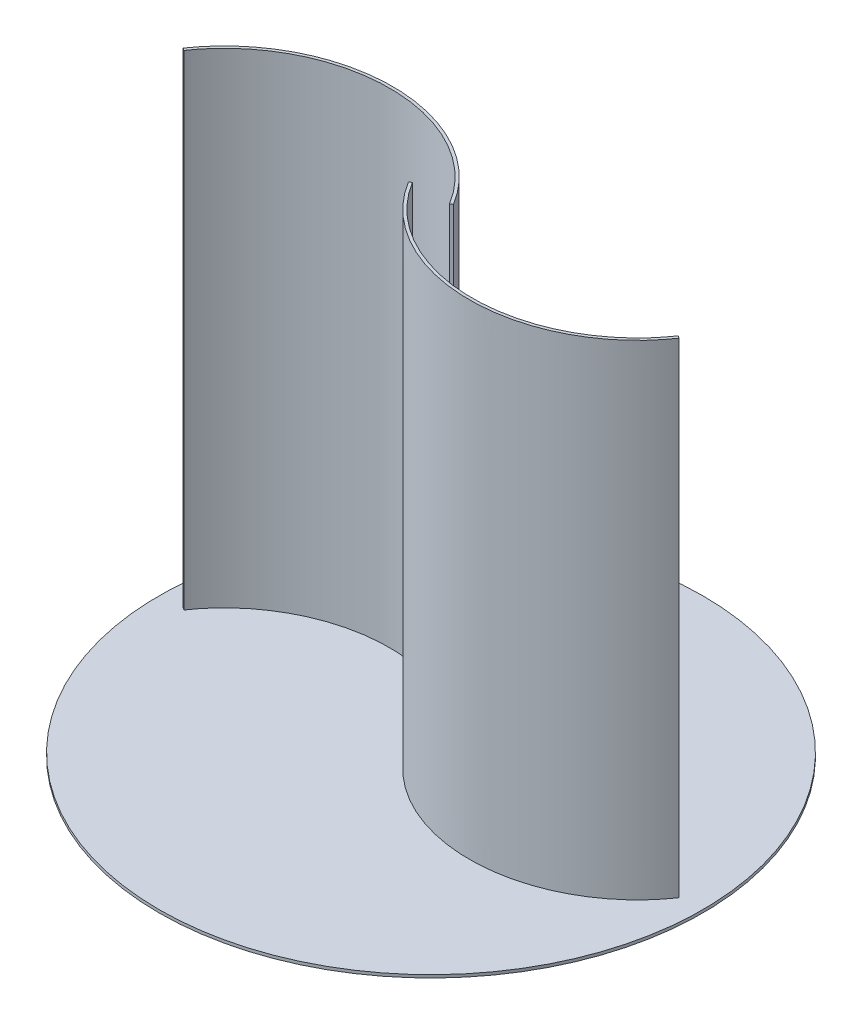
ISO-10303-21;
HEADER;
FILE_DESCRIPTION(('STEP AP214'),'2;1');
FILE_NAME('part.step','',(''),(''),'','','');
FILE_SCHEMA(('AUTOMOTIVE_DESIGN { 1 0 10303 214 1 1 1 1 }'));
ENDSEC;
DATA;
#1=APPLICATION_CONTEXT('core data for automotive mechanical design processes');
#2=APPLICATION_PROTOCOL_DEFINITION('international standard','automotive_design',2000,#1);
#3=PRODUCT_CONTEXT('',#1,'mechanical');
#4=PRODUCT('Part','Part','',(#3));
#5=PRODUCT_RELATED_PRODUCT_CATEGORY('part','',(#4));
#6=PRODUCT_DEFINITION_FORMATION('','',#4);
#7=PRODUCT_DEFINITION_CONTEXT('part definition',#1,'design');
#8=PRODUCT_DEFINITION('design','',#6,#7);
#9=PRODUCT_DEFINITION_SHAPE('','',#8);
#10=(LENGTH_UNIT() NAMED_UNIT(*) SI_UNIT(.MILLI.,.METRE.));
#11=(NAMED_UNIT(*) PLANE_ANGLE_UNIT() SI_UNIT($,.RADIAN.));
#12=(NAMED_UNIT(*) SI_UNIT($,.STERADIAN.) SOLID_ANGLE_UNIT());
#13=UNCERTAINTY_MEASURE_WITH_UNIT(LENGTH_MEASURE(1.E-05),#10,'distance_accuracy_value','');
#14=(GEOMETRIC_REPRESENTATION_CONTEXT(3) GLOBAL_UNCERTAINTY_ASSIGNED_CONTEXT((#13)) GLOBAL_UNIT_ASSIGNED_CONTEXT((#10,
#11,#12)) REPRESENTATION_CONTEXT('',''));
#15=CARTESIAN_POINT('',(0.,0.,0.));
#16=DIRECTION('',(0.,0.,1.));
#17=DIRECTION('',(1.,0.,0.));
#18=AXIS2_PLACEMENT_3D('',#15,#16,#17);
#19=CARTESIAN_POINT('',(0.,0.,0.));
#20=DIRECTION('',(0.,-1.,0.));
#21=DIRECTION('',(0.,0.,-1.));
#22=AXIS2_PLACEMENT_3D('',#19,#20,#21);
#23=PLANE('',#22);
#24=CARTESIAN_POINT('',(0.,0.,0.));
#25=DIRECTION('',(0.,-1.,0.));
#26=DIRECTION('',(0.,0.,-1.));
#27=AXIS2_PLACEMENT_3D('',#24,#25,#26);
#28=CIRCLE('',#27,280.5);
#29=CARTESIAN_POINT('',(0.,0.,-280.5));
#30=VERTEX_POINT('',#29);
#31=EDGE_CURVE('E133',#30,#30,#28,.T.);
#32=ORIENTED_EDGE('',*,*,#31,.F.);
#33=EDGE_LOOP('',(#32));
#34=FACE_BOUND('',#33,.T.);
#35=CARTESIAN_POINT('',(21.6891216393978,0.,-1.55733112033769));
#36=CARTESIAN_POINT('',(18.2745660200291,0.,-7.17934421582622));
#37=CARTESIAN_POINT('',(14.4685671331907,0.,-12.5814688803441));
#38=CARTESIAN_POINT('',(6.13700095641841,0.,-22.8572010216005));
#39=CARTESIAN_POINT('',(1.61147728516747,0.,-27.7307630186297));
#40=CARTESIAN_POINT('',(-8.08395879449895,0.,-36.8696022886165));
#41=CARTESIAN_POINT('',(-13.2538227000232,0.,-41.1348415788702));
#42=CARTESIAN_POINT('',(-24.1523605592156,0.,-48.9875983554629));
#43=CARTESIAN_POINT('',(-29.8809825407018,0.,-52.5750850595787));
#44=CARTESIAN_POINT('',(-41.8025710286876,0.,-59.0142600957211));
#45=CARTESIAN_POINT('',(-47.9954830261697,0.,-61.865924409612));
#46=CARTESIAN_POINT('',(-60.7438996768182,0.,-66.7875589459009));
#47=CARTESIAN_POINT('',(-67.2993478847112,0.,-68.8575115866181));
#48=CARTESIAN_POINT('',(-80.6654652204087,0.,-72.1826307983673));
#49=CARTESIAN_POINT('',(-87.476076438186,0.,-73.4377860882366));
#50=CARTESIAN_POINT('',(-101.241245357681,0.,-75.1134549451564));
#51=CARTESIAN_POINT('',(-108.195744183816,0.,-75.5339635471506));
#52=CARTESIAN_POINT('',(-122.135265016306,0.,-75.5339635471506));
#53=CARTESIAN_POINT('',(-129.120227784404,0.,-75.1134563696446));
#54=CARTESIAN_POINT('',(-143.006878518552,0.,-73.4385828941297));
#55=CARTESIAN_POINT('',(-149.908507595259,0.,-72.1842244486054));
#56=CARTESIAN_POINT('',(-163.51609308129,0.,-68.8622010026352));
#57=CARTESIAN_POINT('',(-170.221991730781,0.,-66.7945502220429));
#58=CARTESIAN_POINT('',(-183.328871450135,0.,-61.8795577117455));
#59=CARTESIAN_POINT('',(-189.729796679758,0.,-59.0322363825765));
#60=CARTESIAN_POINT('',(-202.12234467626,0.,-52.6040612598096));
#61=CARTESIAN_POINT('',(-208.113914261343,0.,-49.0232337440938));
#62=CARTESIAN_POINT('',(-219.589864266089,0.,-41.1860461514666));
#63=CARTESIAN_POINT('',(-225.07419480298,0.,-36.9297178520033));
#64=CARTESIAN_POINT('',(-235.445826561535,0.,-27.8104976655804));
#65=CARTESIAN_POINT('',(-240.333081723937,0.,-22.9476426719762));
#66=CARTESIAN_POINT('',(-249.430210222925,0.,-12.6942756153798));
#67=CARTESIAN_POINT('',(-253.640041761198,0.,-7.30380525238938));
#68=CARTESIAN_POINT('',(-257.476409721345,0.,-1.69333838674669));
#69=B_SPLINE_CURVE_WITH_KNOTS('',3,(#35,#36,#37,#38,#39,#40,#41,#42,#43,#44,#45,#46,#47,#48,#49,
#50,#51,#52,#53,#54,#55,#56,#57,#58,#59,#60,#61,#62,#63,#64,#65,#66,#67,#68),.UNSPECIFIED.,.F.,
.F.,(4,2,2,2,2,2,2,2,2,2,2,2,2,2,2,2,4),(0.,0.0625,0.125,0.1875,0.25,0.3125,0.375,0.4375,
0.499999999999999,0.5625,0.625,0.6875,0.75,0.8125,0.875,0.9375,1.),.UNSPECIFIED.);
#70=CARTESIAN_POINT('',(21.6891216393978,0.,-1.55733112033769));
#71=VERTEX_POINT('',#70);
#72=CARTESIAN_POINT('',(-257.476409721345,0.,-1.6933383867466));
#73=VERTEX_POINT('',#72);
#74=EDGE_CURVE('E187',#71,#73,#69,.T.);
#75=ORIENTED_EDGE('',*,*,#74,.F.);
#76=DIRECTION('',(-0.854707213132575,0.,0.519110373445905));
#77=VECTOR('',#76,1.);
#78=CARTESIAN_POINT('',(21.6891216393978,0.,-1.55733112033769));
#79=LINE('',#78,#77);
#80=CARTESIAN_POINT('',(19.1250000000001,0.,0.));
#81=VERTEX_POINT('',#80);
#82=EDGE_CURVE('E201',#71,#81,#79,.T.);
#83=ORIENTED_EDGE('',*,*,#82,.T.);
#84=CARTESIAN_POINT('',(-120.927559926598,0.,78.2399919294146));
#85=DIRECTION('',(0.,1.,0.));
#86=DIRECTION('',(-0.965925826289069,0.,0.258819045102518));
#87=AXIS2_PLACEMENT_3D('',#84,#85,#86);
#88=ELLIPSE('',#87,161.167836409835,150.);
#89=CARTESIAN_POINT('',(-255.,0.,0.));
#90=VERTEX_POINT('',#89);
#91=EDGE_CURVE('E198',#81,#90,#88,.T.);
#92=ORIENTED_EDGE('',*,*,#91,.T.);
#93=DIRECTION('',(-0.825469907114908,0.,-0.564446128915511));
#94=VECTOR('',#93,1.);
#95=CARTESIAN_POINT('',(-255.,0.,0.));
#96=LINE('',#95,#94);
#97=EDGE_CURVE('E191',#90,#73,#96,.T.);
#98=ORIENTED_EDGE('',*,*,#97,.T.);
#99=EDGE_LOOP('',(#75,#83,#92,#98));
#100=FACE_BOUND('',#99,.T.);
#101=CARTESIAN_POINT('',(-21.6891216393978,0.,1.55733112033784));
#102=CARTESIAN_POINT('',(-18.274566020029,0.,7.17934421582637));
#103=CARTESIAN_POINT('',(-14.4685671331907,0.,12.5814688803443));
#104=CARTESIAN_POINT('',(-6.13700095641839,0.,22.8572010216007));
#105=CARTESIAN_POINT('',(-1.61147728516753,0.,27.7307630186298));
#106=CARTESIAN_POINT('',(8.0839587944989,0.,36.8696022886166));
#107=CARTESIAN_POINT('',(13.2538227000232,0.,41.1348415788703));
#108=CARTESIAN_POINT('',(24.1523605592156,0.,48.9875983554631));
#109=CARTESIAN_POINT('',(29.8809825407018,0.,52.5750850595788));
#110=CARTESIAN_POINT('',(41.8025710286875,0.,59.0142600957213));
#111=CARTESIAN_POINT('',(47.9954830261697,0.,61.8659244096122));
#112=CARTESIAN_POINT('',(60.7438996768182,0.,66.7875589459011));
#113=CARTESIAN_POINT('',(67.2993478847112,0.,68.8575115866182));
#114=CARTESIAN_POINT('',(80.6654652204086,0.,72.1826307983675));
#115=CARTESIAN_POINT('',(87.4760764381861,0.,73.4377860882368));
#116=CARTESIAN_POINT('',(101.241245357681,0.,75.1134549451566));
#117=CARTESIAN_POINT('',(108.195744183816,0.,75.5339635471508));
#118=CARTESIAN_POINT('',(122.135265016306,0.,75.5339635471507));
#119=CARTESIAN_POINT('',(129.120227784405,0.,75.1134563696448));
#120=CARTESIAN_POINT('',(143.006878518552,0.,73.4385828941298));
#121=CARTESIAN_POINT('',(149.908507595259,0.,72.1842244486056));
#122=CARTESIAN_POINT('',(163.51609308129,0.,68.8622010026353));
#123=CARTESIAN_POINT('',(170.221991730781,0.,66.7945502220431));
#124=CARTESIAN_POINT('',(183.328871450135,0.,61.8795577117456));
#125=CARTESIAN_POINT('',(189.729796679758,0.,59.0322363825766));
#126=CARTESIAN_POINT('',(202.12234467626,0.,52.6040612598097));
#127=CARTESIAN_POINT('',(208.113914261343,0.,49.0232337440938));
#128=CARTESIAN_POINT('',(219.589864266089,0.,41.1860461514667));
#129=CARTESIAN_POINT('',(225.07419480298,0.,36.9297178520033));
#130=CARTESIAN_POINT('',(235.445826561535,0.,27.8104976655804));
#131=CARTESIAN_POINT('',(240.333081723937,0.,22.9476426719763));
#132=CARTESIAN_POINT('',(249.430210222925,0.,12.6942756153798));
#133=CARTESIAN_POINT('',(253.640041761198,0.,7.30380525238938));
#134=CARTESIAN_POINT('',(257.476409721345,0.,1.6933383867466));
#135=B_SPLINE_CURVE_WITH_KNOTS('',3,(#101,#102,#103,#104,#105,#106,#107,#108,#109,#110,#111,
#112,#113,#114,#115,#116,#117,#118,#119,#120,#121,#122,#123,#124,#125,#126,#127,#128,#129,#130,
#131,#132,#133,#134),.UNSPECIFIED.,.F.,.F.,(4,2,2,2,2,2,2,2,2,2,2,2,2,2,2,2,4),(0.,0.0625,0.125,
0.1875,0.25,0.3125,0.375,0.4375,0.5,0.5625,0.625,0.6875,0.75,0.8125,0.875,0.9375,1.),.UNSPECIFIED.);
#136=CARTESIAN_POINT('',(-21.6891216393978,0.,1.55733112033778));
#137=VERTEX_POINT('',#136);
#138=CARTESIAN_POINT('',(257.476409721345,0.,1.6933383867466));
#139=VERTEX_POINT('',#138);
#140=EDGE_CURVE('E129',#137,#139,#135,.T.);
#141=ORIENTED_EDGE('',*,*,#140,.F.);
#142=DIRECTION('',(0.854707213132575,0.,-0.519110373445905));
#143=VECTOR('',#142,1.);
#144=CARTESIAN_POINT('',(-21.6891216393978,0.,1.55733112033778));
#145=LINE('',#144,#143);
#146=CARTESIAN_POINT('',(-19.1250000000001,0.,0.));
#147=VERTEX_POINT('',#146);
#148=EDGE_CURVE('E123',#137,#147,#145,.T.);
#149=ORIENTED_EDGE('',*,*,#148,.T.);
#150=CARTESIAN_POINT('',(120.927559926598,0.,-78.2399919294146));
#151=DIRECTION('',(0.,1.,0.));
#152=DIRECTION('',(0.965925826289069,0.,-0.258819045102519));
#153=AXIS2_PLACEMENT_3D('',#150,#151,#152);
#154=ELLIPSE('',#153,161.167836409835,150.);
#155=CARTESIAN_POINT('',(255.,0.,0.));
#156=VERTEX_POINT('',#155);
#157=EDGE_CURVE('E55',#147,#156,#154,.T.);
#158=ORIENTED_EDGE('',*,*,#157,.T.);
#159=DIRECTION('',(0.825469907114908,0.,0.56444612891551));
#160=VECTOR('',#159,1.);
#161=CARTESIAN_POINT('',(255.,0.,0.));
#162=LINE('',#161,#160);
#163=EDGE_CURVE('E233',#156,#139,#162,.T.);
#164=ORIENTED_EDGE('',*,*,#163,.T.);
#165=EDGE_LOOP('',(#141,#149,#158,#164));
#166=FACE_BOUND('',#165,.T.);
#167=ADVANCED_FACE('F39',(#34,#100,#166),#23,.F.);
#168=CARTESIAN_POINT('',(21.6891216393978,500.,-1.55733112033769));
#169=CARTESIAN_POINT('',(18.2745660200291,500.,-7.17934421582622));
#170=CARTESIAN_POINT('',(14.4685671331907,500.,-12.5814688803441));
#171=CARTESIAN_POINT('',(6.13700095641841,500.,-22.8572010216005));
#172=CARTESIAN_POINT('',(1.61147728516747,500.,-27.7307630186297));
#173=CARTESIAN_POINT('',(-8.08395879449895,500.,-36.8696022886165));
#174=CARTESIAN_POINT('',(-13.2538227000232,500.,-41.1348415788702));
#175=CARTESIAN_POINT('',(-24.1523605592156,500.,-48.9875983554629));
#176=CARTESIAN_POINT('',(-29.8809825407018,500.,-52.5750850595787));
#177=CARTESIAN_POINT('',(-41.8025710286876,500.,-59.0142600957211));
#178=CARTESIAN_POINT('',(-47.9954830261697,500.,-61.865924409612));
#179=CARTESIAN_POINT('',(-60.7438996768182,500.,-66.7875589459009));
#180=CARTESIAN_POINT('',(-67.2993478847112,500.,-68.8575115866181));
#181=CARTESIAN_POINT('',(-80.6654652204087,500.,-72.1826307983673));
#182=CARTESIAN_POINT('',(-87.476076438186,500.,-73.4377860882366));
#183=CARTESIAN_POINT('',(-101.241245357681,500.,-75.1134549451564));
#184=CARTESIAN_POINT('',(-108.195744183816,500.,-75.5339635471506));
#185=CARTESIAN_POINT('',(-122.135265016306,500.,-75.5339635471506));
#186=CARTESIAN_POINT('',(-129.120227784404,500.,-75.1134563696446));
#187=CARTESIAN_POINT('',(-143.006878518552,500.,-73.4385828941297));
#188=CARTESIAN_POINT('',(-149.908507595259,500.,-72.1842244486054));
#189=CARTESIAN_POINT('',(-163.51609308129,500.,-68.8622010026352));
#190=CARTESIAN_POINT('',(-170.221991730781,500.,-66.7945502220429));
#191=CARTESIAN_POINT('',(-183.328871450135,500.,-61.8795577117455));
#192=CARTESIAN_POINT('',(-189.729796679758,500.,-59.0322363825765));
#193=CARTESIAN_POINT('',(-202.12234467626,500.,-52.6040612598096));
#194=CARTESIAN_POINT('',(-208.113914261343,500.,-49.0232337440938));
#195=CARTESIAN_POINT('',(-219.589864266089,500.,-41.1860461514666));
#196=CARTESIAN_POINT('',(-225.07419480298,500.,-36.9297178520033));
#197=CARTESIAN_POINT('',(-235.445826561535,500.,-27.8104976655804));
#198=CARTESIAN_POINT('',(-240.333081723937,500.,-22.9476426719762));
#199=CARTESIAN_POINT('',(-249.430210222925,500.,-12.6942756153798));
#200=CARTESIAN_POINT('',(-253.640041761198,500.,-7.30380525238938));
#201=CARTESIAN_POINT('',(-257.476409721345,500.,-1.69333838674669));
#202=B_SPLINE_CURVE_WITH_KNOTS('',3,(#168,#169,#170,#171,#172,#173,#174,#175,#176,#177,#178,
#179,#180,#181,#182,#183,#184,#185,#186,#187,#188,#189,#190,#191,#192,#193,#194,#195,#196,#197,
#198,#199,#200,#201),.UNSPECIFIED.,.F.,.F.,(4,2,2,2,2,2,2,2,2,2,2,2,2,2,2,2,4),(0.,0.0625,0.125,
0.1875,0.25,0.3125,0.375,0.4375,0.499999999999999,0.5625,0.625,0.6875,0.75,0.8125,0.875,0.9375,
1.),.UNSPECIFIED.);
#203=DIRECTION('',(0.,-1.,0.));
#204=VECTOR('',#203,1.);
#205=SURFACE_OF_LINEAR_EXTRUSION('',#202,#204);
#206=ORIENTED_EDGE('',*,*,#74,.T.);
#207=DIRECTION('',(0.,-1.,0.));
#208=VECTOR('',#207,1.);
#209=CARTESIAN_POINT('',(-257.476409721345,500.,-1.6933383867466));
#210=LINE('',#209,#208);
#211=CARTESIAN_POINT('',(-257.476409721345,500.,-1.6933383867466));
#212=VERTEX_POINT('',#211);
#213=EDGE_CURVE('E11',#212,#73,#210,.T.);
#214=ORIENTED_EDGE('',*,*,#213,.F.);
#215=CARTESIAN_POINT('',(21.6891216393978,500.,-1.55733112033769));
#216=VERTEX_POINT('',#215);
#217=EDGE_CURVE('E86',#216,#212,#202,.T.);
#218=ORIENTED_EDGE('',*,*,#217,.F.);
#219=DIRECTION('',(0.,-1.,0.));
#220=VECTOR('',#219,1.);
#221=CARTESIAN_POINT('',(21.6891216393978,500.,-1.55733112033769));
#222=LINE('',#221,#220);
#223=EDGE_CURVE('E64',#216,#71,#222,.T.);
#224=ORIENTED_EDGE('',*,*,#223,.T.);
#225=EDGE_LOOP('',(#206,#214,#218,#224));
#226=FACE_BOUND('',#225,.T.);
#227=ADVANCED_FACE('F41',(#226),#205,.F.);
#228=CARTESIAN_POINT('',(-255.,500.,0.));
#229=DIRECTION('',(-0.564446128915511,0.,0.825469907114908));
#230=DIRECTION('',(0.825469907114908,0.,0.564446128915511));
#231=AXIS2_PLACEMENT_3D('',#228,#229,#230);
#232=PLANE('',#231);
#233=ORIENTED_EDGE('',*,*,#97,.F.);
#234=DIRECTION('',(0.,-1.,0.));
#235=VECTOR('',#234,1.);
#236=CARTESIAN_POINT('',(-255.,500.,0.));
#237=LINE('',#236,#235);
#238=CARTESIAN_POINT('',(-255.,500.,0.));
#239=VERTEX_POINT('',#238);
#240=EDGE_CURVE('E48',#239,#90,#237,.T.);
#241=ORIENTED_EDGE('',*,*,#240,.F.);
#242=DIRECTION('',(-0.825469907114908,0.,-0.564446128915511));
#243=VECTOR('',#242,1.);
#244=CARTESIAN_POINT('',(-255.,500.,0.));
#245=LINE('',#244,#243);
#246=EDGE_CURVE('E185',#239,#212,#245,.T.);
#247=ORIENTED_EDGE('',*,*,#246,.T.);
#248=ORIENTED_EDGE('',*,*,#213,.T.);
#249=EDGE_LOOP('',(#233,#241,#247,#248));
#250=FACE_BOUND('',#249,.T.);
#251=ADVANCED_FACE('F177',(#250),#232,.T.);
#252=CARTESIAN_POINT('',(-120.927559926598,500.,78.2399919294146));
#253=DIRECTION('',(0.,1.,0.));
#254=DIRECTION('',(-0.965925826289069,0.,0.258819045102518));
#255=AXIS2_PLACEMENT_3D('',#252,#253,#254);
#256=ELLIPSE('',#255,161.167836409835,150.);
#257=DIRECTION('',(0.,-1.,0.));
#258=VECTOR('',#257,1.);
#259=SURFACE_OF_LINEAR_EXTRUSION('',#256,#258);
#260=ORIENTED_EDGE('',*,*,#91,.F.);
#261=DIRECTION('',(0.,-1.,0.));
#262=VECTOR('',#261,1.);
#263=CARTESIAN_POINT('',(19.1250000000001,500.,0.));
#264=LINE('',#263,#262);
#265=CARTESIAN_POINT('',(19.1250000000001,500.,0.));
#266=VERTEX_POINT('',#265);
#267=EDGE_CURVE('E205',#266,#81,#264,.T.);
#268=ORIENTED_EDGE('',*,*,#267,.F.);
#269=EDGE_CURVE('E179',#266,#239,#256,.T.);
#270=ORIENTED_EDGE('',*,*,#269,.T.);
#271=ORIENTED_EDGE('',*,*,#240,.T.);
#272=EDGE_LOOP('',(#260,#268,#270,#271));
#273=FACE_BOUND('',#272,.T.);
#274=ADVANCED_FACE('F174',(#273),#259,.T.);
#275=CARTESIAN_POINT('',(21.6891216393978,500.,-1.55733112033769));
#276=DIRECTION('',(0.519110373445905,0.,0.854707213132575));
#277=DIRECTION('',(0.854707213132575,0.,-0.519110373445905));
#278=AXIS2_PLACEMENT_3D('',#275,#276,#277);
#279=PLANE('',#278);
#280=ORIENTED_EDGE('',*,*,#82,.F.);
#281=ORIENTED_EDGE('',*,*,#223,.F.);
#282=DIRECTION('',(-0.854707213132575,0.,0.519110373445905));
#283=VECTOR('',#282,1.);
#284=CARTESIAN_POINT('',(21.6891216393978,500.,-1.55733112033769));
#285=LINE('',#284,#283);
#286=EDGE_CURVE('E184',#216,#266,#285,.T.);
#287=ORIENTED_EDGE('',*,*,#286,.T.);
#288=ORIENTED_EDGE('',*,*,#267,.T.);
#289=EDGE_LOOP('',(#280,#281,#287,#288));
#290=FACE_BOUND('',#289,.T.);
#291=ADVANCED_FACE('F171',(#290),#279,.T.);
#292=CARTESIAN_POINT('',(-115.165504600061,500.,-75.5339635471506));
#293=DIRECTION('',(0.,-1.,0.));
#294=DIRECTION('',(-1.,0.,0.));
#295=AXIS2_PLACEMENT_3D('',#292,#293,#294);
#296=PLANE('',#295);
#297=ORIENTED_EDGE('',*,*,#217,.T.);
#298=ORIENTED_EDGE('',*,*,#246,.F.);
#299=ORIENTED_EDGE('',*,*,#269,.F.);
#300=ORIENTED_EDGE('',*,*,#286,.F.);
#301=EDGE_LOOP('',(#297,#298,#299,#300));
#302=FACE_BOUND('',#301,.T.);
#303=ADVANCED_FACE('F167',(#302),#296,.F.);
#304=CARTESIAN_POINT('',(0.,-3.,0.));
#305=DIRECTION('',(0.,1.,0.));
#306=DIRECTION('',(0.,0.,1.));
#307=AXIS2_PLACEMENT_3D('',#304,#305,#306);
#308=CYLINDRICAL_SURFACE('',#307,280.5);
#309=CARTESIAN_POINT('',(0.,-3.,0.));
#310=DIRECTION('',(0.,-1.,0.));
#311=DIRECTION('',(0.,0.,-1.));
#312=AXIS2_PLACEMENT_3D('',#309,#310,#311);
#313=CIRCLE('',#312,280.5);
#314=CARTESIAN_POINT('',(0.,-3.,-280.5));
#315=VERTEX_POINT('',#314);
#316=EDGE_CURVE('E192',#315,#315,#313,.T.);
#317=ORIENTED_EDGE('',*,*,#316,.F.);
#318=EDGE_LOOP('',(#317));
#319=FACE_BOUND('',#318,.T.);
#320=ORIENTED_EDGE('',*,*,#31,.T.);
#321=EDGE_LOOP('',(#320));
#322=FACE_BOUND('',#321,.T.);
#323=ADVANCED_FACE('F160',(#319,#322),#308,.T.);
#324=CARTESIAN_POINT('',(0.,-3.,0.));
#325=DIRECTION('',(0.,-1.,0.));
#326=DIRECTION('',(0.,0.,-1.));
#327=AXIS2_PLACEMENT_3D('',#324,#325,#326);
#328=PLANE('',#327);
#329=ORIENTED_EDGE('',*,*,#316,.T.);
#330=EDGE_LOOP('',(#329));
#331=FACE_BOUND('',#330,.T.);
#332=ADVANCED_FACE('F157',(#331),#328,.T.);
#333=CARTESIAN_POINT('',(-21.6891216393978,500.,1.55733112033784));
#334=CARTESIAN_POINT('',(-18.274566020029,500.,7.17934421582637));
#335=CARTESIAN_POINT('',(-14.4685671331907,500.,12.5814688803443));
#336=CARTESIAN_POINT('',(-6.13700095641839,500.,22.8572010216007));
#337=CARTESIAN_POINT('',(-1.61147728516753,500.,27.7307630186298));
#338=CARTESIAN_POINT('',(8.0839587944989,500.,36.8696022886166));
#339=CARTESIAN_POINT('',(13.2538227000232,500.,41.1348415788703));
#340=CARTESIAN_POINT('',(24.1523605592156,500.,48.9875983554631));
#341=CARTESIAN_POINT('',(29.8809825407018,500.,52.5750850595788));
#342=CARTESIAN_POINT('',(41.8025710286875,500.,59.0142600957213));
#343=CARTESIAN_POINT('',(47.9954830261697,500.,61.8659244096122));
#344=CARTESIAN_POINT('',(60.7438996768182,500.,66.7875589459011));
#345=CARTESIAN_POINT('',(67.2993478847112,500.,68.8575115866182));
#346=CARTESIAN_POINT('',(80.6654652204086,500.,72.1826307983675));
#347=CARTESIAN_POINT('',(87.4760764381861,500.,73.4377860882368));
#348=CARTESIAN_POINT('',(101.241245357681,500.,75.1134549451566));
#349=CARTESIAN_POINT('',(108.195744183816,500.,75.5339635471508));
#350=CARTESIAN_POINT('',(122.135265016306,500.,75.5339635471507));
#351=CARTESIAN_POINT('',(129.120227784405,500.,75.1134563696448));
#352=CARTESIAN_POINT('',(143.006878518552,500.,73.4385828941298));
#353=CARTESIAN_POINT('',(149.908507595259,500.,72.1842244486056));
#354=CARTESIAN_POINT('',(163.51609308129,500.,68.8622010026353));
#355=CARTESIAN_POINT('',(170.221991730781,500.,66.7945502220431));
#356=CARTESIAN_POINT('',(183.328871450135,500.,61.8795577117456));
#357=CARTESIAN_POINT('',(189.729796679758,500.,59.0322363825766));
#358=CARTESIAN_POINT('',(202.12234467626,500.,52.6040612598097));
#359=CARTESIAN_POINT('',(208.113914261343,500.,49.0232337440938));
#360=CARTESIAN_POINT('',(219.589864266089,500.,41.1860461514667));
#361=CARTESIAN_POINT('',(225.07419480298,500.,36.9297178520033));
#362=CARTESIAN_POINT('',(235.445826561535,500.,27.8104976655804));
#363=CARTESIAN_POINT('',(240.333081723937,500.,22.9476426719763));
#364=CARTESIAN_POINT('',(249.430210222925,500.,12.6942756153798));
#365=CARTESIAN_POINT('',(253.640041761198,500.,7.30380525238938));
#366=CARTESIAN_POINT('',(257.476409721345,500.,1.6933383867466));
#367=B_SPLINE_CURVE_WITH_KNOTS('',3,(#333,#334,#335,#336,#337,#338,#339,#340,#341,#342,#343,
#344,#345,#346,#347,#348,#349,#350,#351,#352,#353,#354,#355,#356,#357,#358,#359,#360,#361,#362,
#363,#364,#365,#366),.UNSPECIFIED.,.F.,.F.,(4,2,2,2,2,2,2,2,2,2,2,2,2,2,2,2,4),(0.,0.0625,0.125,
0.1875,0.25,0.3125,0.375,0.4375,0.5,0.5625,0.625,0.6875,0.75,0.8125,0.875,0.9375,1.),.UNSPECIFIED.);
#368=DIRECTION('',(0.,-1.,0.));
#369=VECTOR('',#368,1.);
#370=SURFACE_OF_LINEAR_EXTRUSION('',#367,#369);
#371=ORIENTED_EDGE('',*,*,#140,.T.);
#372=DIRECTION('',(0.,-1.,0.));
#373=VECTOR('',#372,1.);
#374=CARTESIAN_POINT('',(257.476409721345,500.,1.6933383867466));
#375=LINE('',#374,#373);
#376=CARTESIAN_POINT('',(257.476409721345,500.,1.6933383867466));
#377=VERTEX_POINT('',#376);
#378=EDGE_CURVE('E126',#377,#139,#375,.T.);
#379=ORIENTED_EDGE('',*,*,#378,.F.);
#380=CARTESIAN_POINT('',(-21.6891216393978,500.,1.55733112033778));
#381=VERTEX_POINT('',#380);
#382=EDGE_CURVE('E113',#381,#377,#367,.T.);
#383=ORIENTED_EDGE('',*,*,#382,.F.);
#384=DIRECTION('',(0.,-1.,0.));
#385=VECTOR('',#384,1.);
#386=CARTESIAN_POINT('',(-21.6891216393978,500.,1.55733112033778));
#387=LINE('',#386,#385);
#388=EDGE_CURVE('E228',#381,#137,#387,.T.);
#389=ORIENTED_EDGE('',*,*,#388,.T.);
#390=EDGE_LOOP('',(#371,#379,#383,#389));
#391=FACE_BOUND('',#390,.T.);
#392=ADVANCED_FACE('F127',(#391),#370,.F.);
#393=CARTESIAN_POINT('',(255.,500.,0.));
#394=DIRECTION('',(0.56444612891551,0.,-0.825469907114908));
#395=DIRECTION('',(-0.825469907114908,0.,-0.56444612891551));
#396=AXIS2_PLACEMENT_3D('',#393,#394,#395);
#397=PLANE('',#396);
#398=ORIENTED_EDGE('',*,*,#163,.F.);
#399=DIRECTION('',(0.,-1.,0.));
#400=VECTOR('',#399,1.);
#401=CARTESIAN_POINT('',(255.,500.,0.));
#402=LINE('',#401,#400);
#403=CARTESIAN_POINT('',(255.,500.,0.));
#404=VERTEX_POINT('',#403);
#405=EDGE_CURVE('E134',#404,#156,#402,.T.);
#406=ORIENTED_EDGE('',*,*,#405,.F.);
#407=DIRECTION('',(0.825469907114908,0.,0.56444612891551));
#408=VECTOR('',#407,1.);
#409=CARTESIAN_POINT('',(255.,500.,0.));
#410=LINE('',#409,#408);
#411=EDGE_CURVE('E118',#404,#377,#410,.T.);
#412=ORIENTED_EDGE('',*,*,#411,.T.);
#413=ORIENTED_EDGE('',*,*,#378,.T.);
#414=EDGE_LOOP('',(#398,#406,#412,#413));
#415=FACE_BOUND('',#414,.T.);
#416=ADVANCED_FACE('F136',(#415),#397,.T.);
#417=CARTESIAN_POINT('',(120.927559926598,500.,-78.2399919294146));
#418=DIRECTION('',(0.,1.,0.));
#419=DIRECTION('',(0.965925826289069,0.,-0.258819045102519));
#420=AXIS2_PLACEMENT_3D('',#417,#418,#419);
#421=ELLIPSE('',#420,161.167836409835,150.);
#422=DIRECTION('',(0.,-1.,0.));
#423=VECTOR('',#422,1.);
#424=SURFACE_OF_LINEAR_EXTRUSION('',#421,#423);
#425=ORIENTED_EDGE('',*,*,#157,.F.);
#426=DIRECTION('',(0.,-1.,0.));
#427=VECTOR('',#426,1.);
#428=CARTESIAN_POINT('',(-19.1250000000001,500.,0.));
#429=LINE('',#428,#427);
#430=CARTESIAN_POINT('',(-19.1250000000001,500.,0.));
#431=VERTEX_POINT('',#430);
#432=EDGE_CURVE('E226',#431,#147,#429,.T.);
#433=ORIENTED_EDGE('',*,*,#432,.F.);
#434=EDGE_CURVE('E137',#431,#404,#421,.T.);
#435=ORIENTED_EDGE('',*,*,#434,.T.);
#436=ORIENTED_EDGE('',*,*,#405,.T.);
#437=EDGE_LOOP('',(#425,#433,#435,#436));
#438=FACE_BOUND('',#437,.T.);
#439=ADVANCED_FACE('F147',(#438),#424,.T.);
#440=CARTESIAN_POINT('',(-21.6891216393978,500.,1.55733112033778));
#441=DIRECTION('',(-0.519110373445905,0.,-0.854707213132575));
#442=DIRECTION('',(-0.854707213132575,0.,0.519110373445905));
#443=AXIS2_PLACEMENT_3D('',#440,#441,#442);
#444=PLANE('',#443);
#445=ORIENTED_EDGE('',*,*,#148,.F.);
#446=ORIENTED_EDGE('',*,*,#388,.F.);
#447=DIRECTION('',(0.854707213132575,0.,-0.519110373445905));
#448=VECTOR('',#447,1.);
#449=CARTESIAN_POINT('',(-21.6891216393978,500.,1.55733112033778));
#450=LINE('',#449,#448);
#451=EDGE_CURVE('E121',#381,#431,#450,.T.);
#452=ORIENTED_EDGE('',*,*,#451,.T.);
#453=ORIENTED_EDGE('',*,*,#432,.T.);
#454=EDGE_LOOP('',(#445,#446,#452,#453));
#455=FACE_BOUND('',#454,.T.);
#456=ADVANCED_FACE('F151',(#455),#444,.T.);
#457=CARTESIAN_POINT('',(115.165504600061,500.,75.5339635471508));
#458=DIRECTION('',(0.,-1.,0.));
#459=DIRECTION('',(-1.,0.,0.));
#460=AXIS2_PLACEMENT_3D('',#457,#458,#459);
#461=PLANE('',#460);
#462=ORIENTED_EDGE('',*,*,#382,.T.);
#463=ORIENTED_EDGE('',*,*,#411,.F.);
#464=ORIENTED_EDGE('',*,*,#434,.F.);
#465=ORIENTED_EDGE('',*,*,#451,.F.);
#466=EDGE_LOOP('',(#462,#463,#464,#465));
#467=FACE_BOUND('',#466,.T.);
#468=ADVANCED_FACE('F115',(#467),#461,.F.);
#469=CLOSED_SHELL('',(#167,#227,#251,#274,#291,#303,#323,#332,#392,#416,#439,#456,#468));
#470=MANIFOLD_SOLID_BREP('B2',#469);
#471=ADVANCED_BREP_SHAPE_REPRESENTATION('',(#18,#470),#14);
#472=SHAPE_DEFINITION_REPRESENTATION(#9,#471);
ENDSEC;
END-ISO-10303-21;
